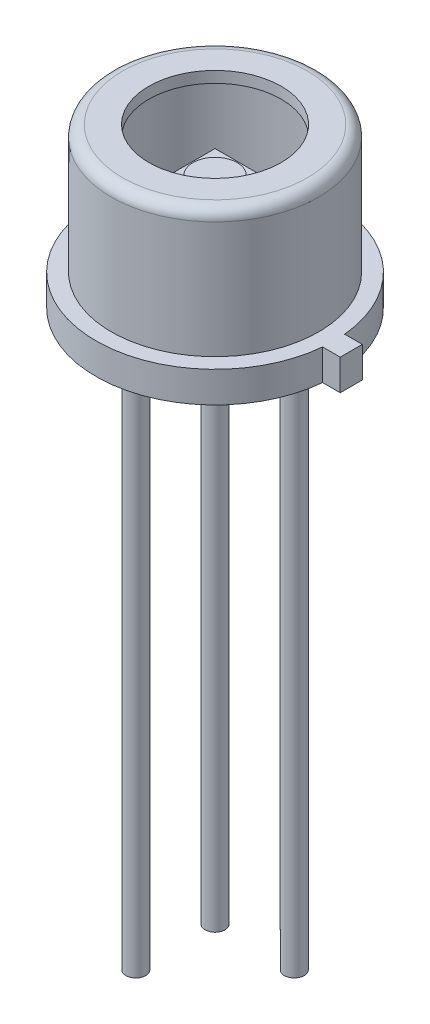
ISO-10303-21;
HEADER;
FILE_DESCRIPTION(('STEP AP214'),'2;1');
FILE_NAME('part.step','',(''),(''),'','','');
FILE_SCHEMA(('AUTOMOTIVE_DESIGN { 1 0 10303 214 1 1 1 1 }'));
ENDSEC;
DATA;
#1=APPLICATION_CONTEXT('core data for automotive mechanical design processes');
#2=APPLICATION_PROTOCOL_DEFINITION('international standard','automotive_design',2000,#1);
#3=PRODUCT_CONTEXT('',#1,'mechanical');
#4=PRODUCT('Part','Part','',(#3));
#5=PRODUCT_RELATED_PRODUCT_CATEGORY('part','',(#4));
#6=PRODUCT_DEFINITION_FORMATION('','',#4);
#7=PRODUCT_DEFINITION_CONTEXT('part definition',#1,'design');
#8=PRODUCT_DEFINITION('design','',#6,#7);
#9=PRODUCT_DEFINITION_SHAPE('','',#8);
#10=(LENGTH_UNIT() NAMED_UNIT(*) SI_UNIT(.MILLI.,.METRE.));
#11=(NAMED_UNIT(*) PLANE_ANGLE_UNIT() SI_UNIT($,.RADIAN.));
#12=(NAMED_UNIT(*) SI_UNIT($,.STERADIAN.) SOLID_ANGLE_UNIT());
#13=UNCERTAINTY_MEASURE_WITH_UNIT(LENGTH_MEASURE(1.E-05),#10,'distance_accuracy_value','');
#14=(GEOMETRIC_REPRESENTATION_CONTEXT(3) GLOBAL_UNCERTAINTY_ASSIGNED_CONTEXT((#13)) GLOBAL_UNIT_ASSIGNED_CONTEXT((#10,
#11,#12)) REPRESENTATION_CONTEXT('',''));
#15=CARTESIAN_POINT('',(0.,0.,0.));
#16=DIRECTION('',(0.,0.,1.));
#17=DIRECTION('',(1.,0.,0.));
#18=AXIS2_PLACEMENT_3D('',#15,#16,#17);
#19=CARTESIAN_POINT('',(-0.625,2.45,0.625));
#20=DIRECTION('',(1.,0.,0.));
#21=DIRECTION('',(0.,0.,-1.));
#22=AXIS2_PLACEMENT_3D('',#19,#20,#21);
#23=PLANE('',#22);
#24=DIRECTION('',(0.,0.,-1.));
#25=VECTOR('',#24,1.);
#26=CARTESIAN_POINT('',(-0.625,2.5,0.625));
#27=LINE('',#26,#25);
#28=CARTESIAN_POINT('',(-0.625,2.5,0.625));
#29=VERTEX_POINT('',#28);
#30=CARTESIAN_POINT('',(-0.624999999999999,2.5,-0.625));
#31=VERTEX_POINT('',#30);
#32=EDGE_CURVE('E115',#29,#31,#27,.T.);
#33=ORIENTED_EDGE('',*,*,#32,.T.);
#34=DIRECTION('',(0.,1.,0.));
#35=VECTOR('',#34,1.);
#36=CARTESIAN_POINT('',(-0.624999999999999,2.45,-0.625));
#37=LINE('',#36,#35);
#38=CARTESIAN_POINT('',(-0.624999999999999,2.45,-0.625));
#39=VERTEX_POINT('',#38);
#40=EDGE_CURVE('E12',#39,#31,#37,.T.);
#41=ORIENTED_EDGE('',*,*,#40,.F.);
#42=DIRECTION('',(0.,0.,-1.));
#43=VECTOR('',#42,1.);
#44=CARTESIAN_POINT('',(-0.625,2.45,0.625));
#45=LINE('',#44,#43);
#46=CARTESIAN_POINT('',(-0.625,2.45,0.625));
#47=VERTEX_POINT('',#46);
#48=EDGE_CURVE('E103',#47,#39,#45,.T.);
#49=ORIENTED_EDGE('',*,*,#48,.F.);
#50=DIRECTION('',(0.,1.,0.));
#51=VECTOR('',#50,1.);
#52=CARTESIAN_POINT('',(-0.625,2.45,0.625));
#53=LINE('',#52,#51);
#54=EDGE_CURVE('E111',#47,#29,#53,.T.);
#55=ORIENTED_EDGE('',*,*,#54,.T.);
#56=EDGE_LOOP('',(#33,#41,#49,#55));
#57=FACE_BOUND('',#56,.T.);
#58=ADVANCED_FACE('F52',(#57),#23,.F.);
#59=CARTESIAN_POINT('',(-0.624999999999999,2.45,-0.625));
#60=DIRECTION('',(0.,0.,1.));
#61=DIRECTION('',(1.,0.,0.));
#62=AXIS2_PLACEMENT_3D('',#59,#60,#61);
#63=PLANE('',#62);
#64=DIRECTION('',(1.,0.,0.));
#65=VECTOR('',#64,1.);
#66=CARTESIAN_POINT('',(-0.624999999999999,2.5,-0.625));
#67=LINE('',#66,#65);
#68=CARTESIAN_POINT('',(0.625000000000001,2.5,-0.625));
#69=VERTEX_POINT('',#68);
#70=EDGE_CURVE('E107',#31,#69,#67,.T.);
#71=ORIENTED_EDGE('',*,*,#70,.T.);
#72=DIRECTION('',(0.,1.,0.));
#73=VECTOR('',#72,1.);
#74=CARTESIAN_POINT('',(0.625000000000001,2.45,-0.625));
#75=LINE('',#74,#73);
#76=CARTESIAN_POINT('',(0.625000000000001,2.45,-0.625));
#77=VERTEX_POINT('',#76);
#78=EDGE_CURVE('E60',#77,#69,#75,.T.);
#79=ORIENTED_EDGE('',*,*,#78,.F.);
#80=DIRECTION('',(1.,0.,0.));
#81=VECTOR('',#80,1.);
#82=CARTESIAN_POINT('',(-0.624999999999999,2.45,-0.625));
#83=LINE('',#82,#81);
#84=EDGE_CURVE('E98',#39,#77,#83,.T.);
#85=ORIENTED_EDGE('',*,*,#84,.F.);
#86=ORIENTED_EDGE('',*,*,#40,.T.);
#87=EDGE_LOOP('',(#71,#79,#85,#86));
#88=FACE_BOUND('',#87,.T.);
#89=ADVANCED_FACE('F106',(#88),#63,.F.);
#90=CARTESIAN_POINT('',(0.625,2.45,0.625));
#91=DIRECTION('',(-1.,0.,0.));
#92=DIRECTION('',(0.,0.,1.));
#93=AXIS2_PLACEMENT_3D('',#90,#91,#92);
#94=PLANE('',#93);
#95=DIRECTION('',(0.,0.,1.));
#96=VECTOR('',#95,1.);
#97=CARTESIAN_POINT('',(0.625,2.5,0.625));
#98=LINE('',#97,#96);
#99=CARTESIAN_POINT('',(0.625,2.5,0.625));
#100=VERTEX_POINT('',#99);
#101=EDGE_CURVE('E85',#69,#100,#98,.T.);
#102=ORIENTED_EDGE('',*,*,#101,.T.);
#103=DIRECTION('',(0.,1.,0.));
#104=VECTOR('',#103,1.);
#105=CARTESIAN_POINT('',(0.625,2.45,0.625));
#106=LINE('',#105,#104);
#107=CARTESIAN_POINT('',(0.625,2.45,0.625));
#108=VERTEX_POINT('',#107);
#109=EDGE_CURVE('E108',#108,#100,#106,.T.);
#110=ORIENTED_EDGE('',*,*,#109,.F.);
#111=DIRECTION('',(0.,0.,1.));
#112=VECTOR('',#111,1.);
#113=CARTESIAN_POINT('',(0.625,2.45,0.625));
#114=LINE('',#113,#112);
#115=EDGE_CURVE('E101',#77,#108,#114,.T.);
#116=ORIENTED_EDGE('',*,*,#115,.F.);
#117=ORIENTED_EDGE('',*,*,#78,.T.);
#118=EDGE_LOOP('',(#102,#110,#116,#117));
#119=FACE_BOUND('',#118,.T.);
#120=ADVANCED_FACE('F109',(#119),#94,.F.);
#121=CARTESIAN_POINT('',(-0.625,2.45,0.625));
#122=DIRECTION('',(0.,0.,-1.));
#123=DIRECTION('',(-1.,0.,0.));
#124=AXIS2_PLACEMENT_3D('',#121,#122,#123);
#125=PLANE('',#124);
#126=DIRECTION('',(-1.,0.,0.));
#127=VECTOR('',#126,1.);
#128=CARTESIAN_POINT('',(-0.625,2.5,0.625));
#129=LINE('',#128,#127);
#130=EDGE_CURVE('E91',#100,#29,#129,.T.);
#131=ORIENTED_EDGE('',*,*,#130,.T.);
#132=ORIENTED_EDGE('',*,*,#54,.F.);
#133=DIRECTION('',(-1.,0.,0.));
#134=VECTOR('',#133,1.);
#135=CARTESIAN_POINT('',(-0.625,2.45,0.625));
#136=LINE('',#135,#134);
#137=EDGE_CURVE('E68',#108,#47,#136,.T.);
#138=ORIENTED_EDGE('',*,*,#137,.F.);
#139=ORIENTED_EDGE('',*,*,#109,.T.);
#140=EDGE_LOOP('',(#131,#132,#138,#139));
#141=FACE_BOUND('',#140,.T.);
#142=ADVANCED_FACE('F123',(#141),#125,.F.);
#143=CARTESIAN_POINT('',(-0.624999999999999,2.45,-0.625));
#144=DIRECTION('',(0.,-1.,0.));
#145=DIRECTION('',(0.,0.,-1.));
#146=AXIS2_PLACEMENT_3D('',#143,#144,#145);
#147=PLANE('',#146);
#148=ORIENTED_EDGE('',*,*,#48,.T.);
#149=ORIENTED_EDGE('',*,*,#84,.T.);
#150=ORIENTED_EDGE('',*,*,#115,.T.);
#151=ORIENTED_EDGE('',*,*,#137,.T.);
#152=EDGE_LOOP('',(#148,#149,#150,#151));
#153=FACE_BOUND('',#152,.T.);
#154=ADVANCED_FACE('F99',(#153),#147,.T.);
#155=CARTESIAN_POINT('',(-0.624999999999999,2.5,-0.625));
#156=DIRECTION('',(0.,-1.,0.));
#157=DIRECTION('',(0.,0.,-1.));
#158=AXIS2_PLACEMENT_3D('',#155,#156,#157);
#159=PLANE('',#158);
#160=CARTESIAN_POINT('',(0.,2.5,0.));
#161=DIRECTION('',(0.,-1.,0.));
#162=DIRECTION('',(0.,0.,-1.));
#163=AXIS2_PLACEMENT_3D('',#160,#161,#162);
#164=CIRCLE('',#163,0.5);
#165=CARTESIAN_POINT('',(0.,2.5,-0.5));
#166=VERTEX_POINT('',#165);
#167=EDGE_CURVE('E129',#166,#166,#164,.T.);
#168=ORIENTED_EDGE('',*,*,#167,.T.);
#169=EDGE_LOOP('',(#168));
#170=FACE_BOUND('',#169,.T.);
#171=ORIENTED_EDGE('',*,*,#32,.F.);
#172=ORIENTED_EDGE('',*,*,#130,.F.);
#173=ORIENTED_EDGE('',*,*,#101,.F.);
#174=ORIENTED_EDGE('',*,*,#70,.F.);
#175=EDGE_LOOP('',(#171,#172,#173,#174));
#176=FACE_BOUND('',#175,.T.);
#177=ADVANCED_FACE('F126',(#170,#176),#159,.F.);
#178=CARTESIAN_POINT('',(0.,2.6,0.));
#179=DIRECTION('',(0.,-1.,0.));
#180=DIRECTION('',(0.,0.,-1.));
#181=AXIS2_PLACEMENT_3D('',#178,#179,#180);
#182=CYLINDRICAL_SURFACE('',#181,0.5);
#183=CARTESIAN_POINT('',(0.,2.6,0.));
#184=DIRECTION('',(0.,-1.,0.));
#185=DIRECTION('',(0.,0.,-1.));
#186=AXIS2_PLACEMENT_3D('',#183,#184,#185);
#187=CIRCLE('',#186,0.5);
#188=CARTESIAN_POINT('',(0.,2.6,-0.5));
#189=VERTEX_POINT('',#188);
#190=EDGE_CURVE('E118',#189,#189,#187,.T.);
#191=ORIENTED_EDGE('',*,*,#190,.T.);
#192=EDGE_LOOP('',(#191));
#193=FACE_BOUND('',#192,.T.);
#194=ORIENTED_EDGE('',*,*,#167,.F.);
#195=EDGE_LOOP('',(#194));
#196=FACE_BOUND('',#195,.T.);
#197=ADVANCED_FACE('F135',(#193,#196),#182,.T.);
#198=CARTESIAN_POINT('',(0.,2.6,0.));
#199=DIRECTION('',(0.,-1.,0.));
#200=DIRECTION('',(0.,0.,-1.));
#201=AXIS2_PLACEMENT_3D('',#198,#199,#200);
#202=PLANE('',#201);
#203=ORIENTED_EDGE('',*,*,#190,.F.);
#204=EDGE_LOOP('',(#203));
#205=FACE_BOUND('',#204,.T.);
#206=ADVANCED_FACE('F138',(#205),#202,.F.);
#207=CLOSED_SHELL('',(#58,#89,#120,#142,#154,#177,#197,#206));
#208=MANIFOLD_SOLID_BREP('B2',#207);
#209=CARTESIAN_POINT('',(2.7,0.,0.));
#210=DIRECTION('',(0.,1.,0.));
#211=DIRECTION('',(0.,0.,1.));
#212=AXIS2_PLACEMENT_3D('',#209,#210,#211);
#213=PLANE('',#212);
#214=CARTESIAN_POINT('',(0.898025612106904,0.,-0.898025612106927));
#215=DIRECTION('',(0.,1.,0.));
#216=DIRECTION('',(0.,0.,1.));
#217=AXIS2_PLACEMENT_3D('',#214,#215,#216);
#218=CIRCLE('',#217,0.225);
#219=CARTESIAN_POINT('',(0.898025612106904,0.,-0.673025612106927));
#220=VERTEX_POINT('',#219);
#221=EDGE_CURVE('E221',#220,#220,#218,.F.);
#222=ORIENTED_EDGE('',*,*,#221,.F.);
#223=EDGE_LOOP('',(#222));
#224=FACE_BOUND('',#223,.T.);
#225=CARTESIAN_POINT('',(0.,0.,0.));
#226=DIRECTION('',(0.,-1.,0.));
#227=DIRECTION('',(0.,0.,-1.));
#228=AXIS2_PLACEMENT_3D('',#225,#226,#227);
#229=CIRCLE('',#228,2.7);
#230=CARTESIAN_POINT('',(2.68840101175401,0.,0.250000000000029));
#231=VERTEX_POINT('',#230);
#232=CARTESIAN_POINT('',(2.68840101175402,0.,-0.249999999999971));
#233=VERTEX_POINT('',#232);
#234=EDGE_CURVE('E228',#231,#233,#229,.T.);
#235=ORIENTED_EDGE('',*,*,#234,.T.);
#236=DIRECTION('',(-1.,0.,0.));
#237=VECTOR('',#236,1.);
#238=CARTESIAN_POINT('',(0.,0.,-0.250000000000001));
#239=LINE('',#238,#237);
#240=CARTESIAN_POINT('',(3.08840101175402,0.,-0.249999999999967));
#241=VERTEX_POINT('',#240);
#242=EDGE_CURVE('E278',#241,#233,#239,.T.);
#243=ORIENTED_EDGE('',*,*,#242,.F.);
#244=DIRECTION('',(0.,0.,1.));
#245=VECTOR('',#244,1.);
#246=CARTESIAN_POINT('',(3.08840101175401,0.,0.));
#247=LINE('',#246,#245);
#248=CARTESIAN_POINT('',(3.08840101175401,0.,0.250000000000033));
#249=VERTEX_POINT('',#248);
#250=EDGE_CURVE('E272',#241,#249,#247,.T.);
#251=ORIENTED_EDGE('',*,*,#250,.T.);
#252=DIRECTION('',(-1.,0.,0.));
#253=VECTOR('',#252,1.);
#254=CARTESIAN_POINT('',(0.,0.,0.250000000000001));
#255=LINE('',#254,#253);
#256=EDGE_CURVE('E270',#249,#231,#255,.T.);
#257=ORIENTED_EDGE('',*,*,#256,.T.);
#258=EDGE_LOOP('',(#235,#243,#251,#257));
#259=FACE_BOUND('',#258,.T.);
#260=CARTESIAN_POINT('',(-0.898025612106926,0.,0.898025612106904));
#261=DIRECTION('',(0.,1.,0.));
#262=DIRECTION('',(0.,0.,1.));
#263=AXIS2_PLACEMENT_3D('',#260,#261,#262);
#264=CIRCLE('',#263,0.225);
#265=CARTESIAN_POINT('',(-0.898025612106926,0.,1.1230256121069));
#266=VERTEX_POINT('',#265);
#267=EDGE_CURVE('E306',#266,#266,#264,.F.);
#268=ORIENTED_EDGE('',*,*,#267,.F.);
#269=EDGE_LOOP('',(#268));
#270=FACE_BOUND('',#269,.T.);
#271=CARTESIAN_POINT('',(-0.898025612106927,0.,-0.898025612106927));
#272=DIRECTION('',(0.,1.,0.));
#273=DIRECTION('',(0.,0.,1.));
#274=AXIS2_PLACEMENT_3D('',#271,#272,#273);
#275=CIRCLE('',#274,0.225);
#276=CARTESIAN_POINT('',(-0.898025612106927,0.,-0.673025612106927));
#277=VERTEX_POINT('',#276);
#278=EDGE_CURVE('E50',#277,#277,#275,.F.);
#279=ORIENTED_EDGE('',*,*,#278,.F.);
#280=EDGE_LOOP('',(#279));
#281=FACE_BOUND('',#280,.T.);
#282=ADVANCED_FACE('F213',(#224,#259,#270,#281),#213,.F.);
#283=CARTESIAN_POINT('',(2.096,3.6,0.));
#284=DIRECTION('',(0.,1.,0.));
#285=DIRECTION('',(0.,0.,1.));
#286=AXIS2_PLACEMENT_3D('',#283,#284,#285);
#287=PLANE('',#286);
#288=CARTESIAN_POINT('',(0.,3.6,0.));
#289=DIRECTION('',(0.,-1.,0.));
#290=DIRECTION('',(0.,0.,-1.));
#291=AXIS2_PLACEMENT_3D('',#288,#289,#290);
#292=CIRCLE('',#291,1.5);
#293=CARTESIAN_POINT('',(0.,3.6,-1.5));
#294=VERTEX_POINT('',#293);
#295=EDGE_CURVE('E303',#294,#294,#292,.T.);
#296=ORIENTED_EDGE('',*,*,#295,.T.);
#297=EDGE_LOOP('',(#296));
#298=FACE_BOUND('',#297,.T.);
#299=CARTESIAN_POINT('',(0.,3.6,0.));
#300=DIRECTION('',(0.,-1.,0.));
#301=DIRECTION('',(0.,0.,-1.));
#302=AXIS2_PLACEMENT_3D('',#299,#300,#301);
#303=CIRCLE('',#302,2.096);
#304=CARTESIAN_POINT('',(0.,3.6,-2.096));
#305=VERTEX_POINT('',#304);
#306=EDGE_CURVE('E288',#305,#305,#303,.T.);
#307=ORIENTED_EDGE('',*,*,#306,.F.);
#308=EDGE_LOOP('',(#307));
#309=FACE_BOUND('',#308,.T.);
#310=ADVANCED_FACE('F215',(#298,#309),#287,.T.);
#311=CARTESIAN_POINT('',(0.,0.,0.));
#312=DIRECTION('',(0.,-1.,0.));
#313=DIRECTION('',(0.,0.,-1.));
#314=AXIS2_PLACEMENT_3D('',#311,#312,#313);
#315=CYLINDRICAL_SURFACE('',#314,1.5);
#316=ORIENTED_EDGE('',*,*,#295,.F.);
#317=EDGE_LOOP('',(#316));
#318=FACE_BOUND('',#317,.T.);
#319=CARTESIAN_POINT('',(0.,3.346,0.));
#320=DIRECTION('',(0.,-1.,0.));
#321=DIRECTION('',(0.,0.,-1.));
#322=AXIS2_PLACEMENT_3D('',#319,#320,#321);
#323=CIRCLE('',#322,1.5);
#324=CARTESIAN_POINT('',(0.,3.346,-1.5));
#325=VERTEX_POINT('',#324);
#326=EDGE_CURVE('E300',#325,#325,#323,.T.);
#327=ORIENTED_EDGE('',*,*,#326,.T.);
#328=EDGE_LOOP('',(#327));
#329=FACE_BOUND('',#328,.T.);
#330=ADVANCED_FACE('F383',(#318,#329),#315,.F.);
#331=CARTESIAN_POINT('',(2.096,3.346,0.));
#332=DIRECTION('',(0.,1.,0.));
#333=DIRECTION('',(0.,0.,1.));
#334=AXIS2_PLACEMENT_3D('',#331,#332,#333);
#335=PLANE('',#334);
#336=ORIENTED_EDGE('',*,*,#326,.F.);
#337=EDGE_LOOP('',(#336));
#338=FACE_BOUND('',#337,.T.);
#339=CARTESIAN_POINT('',(0.,3.346,0.));
#340=DIRECTION('',(0.,-1.,0.));
#341=DIRECTION('',(0.,0.,-1.));
#342=AXIS2_PLACEMENT_3D('',#339,#340,#341);
#343=CIRCLE('',#342,2.096);
#344=CARTESIAN_POINT('',(0.,3.346,-2.096));
#345=VERTEX_POINT('',#344);
#346=EDGE_CURVE('E297',#345,#345,#343,.T.);
#347=ORIENTED_EDGE('',*,*,#346,.T.);
#348=EDGE_LOOP('',(#347));
#349=FACE_BOUND('',#348,.T.);
#350=ADVANCED_FACE('F380',(#338,#349),#335,.F.);
#351=CARTESIAN_POINT('',(0.,0.,0.));
#352=DIRECTION('',(0.,-1.,0.));
#353=DIRECTION('',(0.,0.,-1.));
#354=AXIS2_PLACEMENT_3D('',#351,#352,#353);
#355=CYLINDRICAL_SURFACE('',#354,2.096);
#356=ORIENTED_EDGE('',*,*,#346,.F.);
#357=EDGE_LOOP('',(#356));
#358=FACE_BOUND('',#357,.T.);
#359=CARTESIAN_POINT('',(0.,0.446,0.));
#360=DIRECTION('',(0.,1.,0.));
#361=DIRECTION('',(0.,0.,1.));
#362=AXIS2_PLACEMENT_3D('',#359,#360,#361);
#363=CIRCLE('',#362,2.096);
#364=CARTESIAN_POINT('',(0.,0.446,2.096));
#365=VERTEX_POINT('',#364);
#366=EDGE_CURVE('E285',#365,#365,#363,.F.);
#367=ORIENTED_EDGE('',*,*,#366,.T.);
#368=EDGE_LOOP('',(#367));
#369=FACE_BOUND('',#368,.T.);
#370=ADVANCED_FACE('F376',(#358,#369),#355,.F.);
#371=CARTESIAN_POINT('',(0.,0.,0.));
#372=DIRECTION('',(0.,-1.,0.));
#373=DIRECTION('',(0.,0.,-1.));
#374=AXIS2_PLACEMENT_3D('',#371,#372,#373);
#375=CYLINDRICAL_SURFACE('',#374,2.7);
#376=DIRECTION('',(0.,-1.,0.));
#377=VECTOR('',#376,1.);
#378=CARTESIAN_POINT('',(2.68840101175401,1.34031242374329,0.250000000000029));
#379=LINE('',#378,#377);
#380=CARTESIAN_POINT('',(2.68840101175401,0.7,0.250000000000029));
#381=VERTEX_POINT('',#380);
#382=EDGE_CURVE('E261',#381,#231,#379,.T.);
#383=ORIENTED_EDGE('',*,*,#382,.F.);
#384=CARTESIAN_POINT('',(0.,0.7,0.));
#385=DIRECTION('',(0.,-1.,0.));
#386=DIRECTION('',(0.,0.,-1.));
#387=AXIS2_PLACEMENT_3D('',#384,#385,#386);
#388=CIRCLE('',#387,2.7);
#389=CARTESIAN_POINT('',(2.68840101175402,0.7,-0.249999999999971));
#390=VERTEX_POINT('',#389);
#391=EDGE_CURVE('E252',#381,#390,#388,.T.);
#392=ORIENTED_EDGE('',*,*,#391,.T.);
#393=DIRECTION('',(0.,-1.,0.));
#394=VECTOR('',#393,1.);
#395=CARTESIAN_POINT('',(2.68840101175402,1.34031242374329,-0.249999999999971));
#396=LINE('',#395,#394);
#397=EDGE_CURVE('E233',#390,#233,#396,.T.);
#398=ORIENTED_EDGE('',*,*,#397,.T.);
#399=ORIENTED_EDGE('',*,*,#234,.F.);
#400=EDGE_LOOP('',(#383,#392,#398,#399));
#401=FACE_BOUND('',#400,.T.);
#402=ADVANCED_FACE('F262',(#401),#375,.T.);
#403=CARTESIAN_POINT('',(2.7,0.7,0.));
#404=DIRECTION('',(0.,1.,0.));
#405=DIRECTION('',(0.,0.,1.));
#406=AXIS2_PLACEMENT_3D('',#403,#404,#405);
#407=PLANE('',#406);
#408=CARTESIAN_POINT('',(0.,0.7,0.));
#409=DIRECTION('',(0.,-1.,0.));
#410=DIRECTION('',(0.,0.,-1.));
#411=AXIS2_PLACEMENT_3D('',#408,#409,#410);
#412=CIRCLE('',#411,2.35);
#413=CARTESIAN_POINT('',(0.,0.7,-2.35));
#414=VERTEX_POINT('',#413);
#415=EDGE_CURVE('E259',#414,#414,#412,.T.);
#416=ORIENTED_EDGE('',*,*,#415,.T.);
#417=EDGE_LOOP('',(#416));
#418=FACE_BOUND('',#417,.T.);
#419=ORIENTED_EDGE('',*,*,#391,.F.);
#420=DIRECTION('',(-1.,0.,0.));
#421=VECTOR('',#420,1.);
#422=CARTESIAN_POINT('',(0.,0.7,0.250000000000001));
#423=LINE('',#422,#421);
#424=CARTESIAN_POINT('',(3.08840101175401,0.7,0.250000000000033));
#425=VERTEX_POINT('',#424);
#426=EDGE_CURVE('E255',#425,#381,#423,.T.);
#427=ORIENTED_EDGE('',*,*,#426,.F.);
#428=DIRECTION('',(0.,0.,1.));
#429=VECTOR('',#428,1.);
#430=CARTESIAN_POINT('',(3.08840101175401,0.7,0.));
#431=LINE('',#430,#429);
#432=CARTESIAN_POINT('',(3.08840101175402,0.7,-0.249999999999967));
#433=VERTEX_POINT('',#432);
#434=EDGE_CURVE('E276',#433,#425,#431,.T.);
#435=ORIENTED_EDGE('',*,*,#434,.F.);
#436=DIRECTION('',(-1.,0.,0.));
#437=VECTOR('',#436,1.);
#438=CARTESIAN_POINT('',(0.,0.7,-0.250000000000001));
#439=LINE('',#438,#437);
#440=EDGE_CURVE('E258',#433,#390,#439,.T.);
#441=ORIENTED_EDGE('',*,*,#440,.T.);
#442=EDGE_LOOP('',(#419,#427,#435,#441));
#443=FACE_BOUND('',#442,.T.);
#444=ADVANCED_FACE('F253',(#418,#443),#407,.T.);
#445=CARTESIAN_POINT('',(0.,0.,0.));
#446=DIRECTION('',(0.,-1.,0.));
#447=DIRECTION('',(0.,0.,-1.));
#448=AXIS2_PLACEMENT_3D('',#445,#446,#447);
#449=CYLINDRICAL_SURFACE('',#448,2.35);
#450=CARTESIAN_POINT('',(0.,3.346,0.));
#451=DIRECTION('',(0.,-1.,0.));
#452=DIRECTION('',(0.,0.,-1.));
#453=AXIS2_PLACEMENT_3D('',#450,#451,#452);
#454=CIRCLE('',#453,2.35);
#455=CARTESIAN_POINT('',(0.,3.346,-2.35));
#456=VERTEX_POINT('',#455);
#457=EDGE_CURVE('E291',#456,#456,#454,.T.);
#458=ORIENTED_EDGE('',*,*,#457,.T.);
#459=EDGE_LOOP('',(#458));
#460=FACE_BOUND('',#459,.T.);
#461=ORIENTED_EDGE('',*,*,#415,.F.);
#462=EDGE_LOOP('',(#461));
#463=FACE_BOUND('',#462,.T.);
#464=ADVANCED_FACE('F367',(#460,#463),#449,.T.);
#465=CARTESIAN_POINT('',(0.,3.346,0.));
#466=DIRECTION('',(0.,-1.,0.));
#467=DIRECTION('',(0.,0.,-1.));
#468=AXIS2_PLACEMENT_3D('',#465,#466,#467);
#469=TOROIDAL_SURFACE('',#468,2.096,0.254);
#470=ORIENTED_EDGE('',*,*,#306,.T.);
#471=EDGE_LOOP('',(#470));
#472=FACE_BOUND('',#471,.T.);
#473=ORIENTED_EDGE('',*,*,#457,.F.);
#474=EDGE_LOOP('',(#473));
#475=FACE_BOUND('',#474,.T.);
#476=ADVANCED_FACE('F363',(#472,#475),#469,.T.);
#477=CARTESIAN_POINT('',(2.7,0.446,0.));
#478=DIRECTION('',(0.,1.,0.));
#479=DIRECTION('',(0.,0.,1.));
#480=AXIS2_PLACEMENT_3D('',#477,#478,#479);
#481=PLANE('',#480);
#482=ORIENTED_EDGE('',*,*,#366,.F.);
#483=EDGE_LOOP('',(#482));
#484=FACE_BOUND('',#483,.T.);
#485=ADVANCED_FACE('F360',(#484),#481,.T.);
#486=CARTESIAN_POINT('',(0.,1.34031242374329,0.250000000000001));
#487=DIRECTION('',(0.,0.,1.));
#488=DIRECTION('',(1.,0.,0.));
#489=AXIS2_PLACEMENT_3D('',#486,#487,#488);
#490=PLANE('',#489);
#491=DIRECTION('',(0.,-1.,0.));
#492=VECTOR('',#491,1.);
#493=CARTESIAN_POINT('',(3.08840101175401,1.34031242374329,0.250000000000033));
#494=LINE('',#493,#492);
#495=EDGE_CURVE('E269',#425,#249,#494,.T.);
#496=ORIENTED_EDGE('',*,*,#495,.F.);
#497=ORIENTED_EDGE('',*,*,#426,.T.);
#498=ORIENTED_EDGE('',*,*,#382,.T.);
#499=ORIENTED_EDGE('',*,*,#256,.F.);
#500=EDGE_LOOP('',(#496,#497,#498,#499));
#501=FACE_BOUND('',#500,.T.);
#502=ADVANCED_FACE('F268',(#501),#490,.T.);
#503=CARTESIAN_POINT('',(0.,1.34031242374329,-0.250000000000001));
#504=DIRECTION('',(0.,0.,1.));
#505=DIRECTION('',(1.,0.,0.));
#506=AXIS2_PLACEMENT_3D('',#503,#504,#505);
#507=PLANE('',#506);
#508=ORIENTED_EDGE('',*,*,#440,.F.);
#509=DIRECTION('',(0.,-1.,0.));
#510=VECTOR('',#509,1.);
#511=CARTESIAN_POINT('',(3.08840101175402,1.34031242374329,-0.249999999999967));
#512=LINE('',#511,#510);
#513=EDGE_CURVE('E281',#433,#241,#512,.T.);
#514=ORIENTED_EDGE('',*,*,#513,.T.);
#515=ORIENTED_EDGE('',*,*,#242,.T.);
#516=ORIENTED_EDGE('',*,*,#397,.F.);
#517=EDGE_LOOP('',(#508,#514,#515,#516));
#518=FACE_BOUND('',#517,.T.);
#519=ADVANCED_FACE('F353',(#518),#507,.F.);
#520=CARTESIAN_POINT('',(3.08840101175401,1.34031242374329,0.));
#521=DIRECTION('',(1.,0.,0.));
#522=DIRECTION('',(0.,0.,-1.));
#523=AXIS2_PLACEMENT_3D('',#520,#521,#522);
#524=PLANE('',#523);
#525=ORIENTED_EDGE('',*,*,#513,.F.);
#526=ORIENTED_EDGE('',*,*,#434,.T.);
#527=ORIENTED_EDGE('',*,*,#495,.T.);
#528=ORIENTED_EDGE('',*,*,#250,.F.);
#529=EDGE_LOOP('',(#525,#526,#527,#528));
#530=FACE_BOUND('',#529,.T.);
#531=ADVANCED_FACE('F349',(#530),#524,.T.);
#532=CARTESIAN_POINT('',(-0.898025612106926,-13.,0.898025612106904));
#533=DIRECTION('',(0.,1.,0.));
#534=DIRECTION('',(0.,0.,1.));
#535=AXIS2_PLACEMENT_3D('',#532,#533,#534);
#536=CYLINDRICAL_SURFACE('',#535,0.225);
#537=CARTESIAN_POINT('',(-0.898025612106926,-13.,0.898025612106904));
#538=DIRECTION('',(0.,-1.,0.));
#539=DIRECTION('',(0.,0.,-1.));
#540=AXIS2_PLACEMENT_3D('',#537,#538,#539);
#541=CIRCLE('',#540,0.225);
#542=CARTESIAN_POINT('',(-0.898025612106926,-13.,0.673025612106904));
#543=VERTEX_POINT('',#542);
#544=EDGE_CURVE('E280',#543,#543,#541,.T.);
#545=ORIENTED_EDGE('',*,*,#544,.F.);
#546=EDGE_LOOP('',(#545));
#547=FACE_BOUND('',#546,.T.);
#548=ORIENTED_EDGE('',*,*,#267,.T.);
#549=EDGE_LOOP('',(#548));
#550=FACE_BOUND('',#549,.T.);
#551=ADVANCED_FACE('F345',(#547,#550),#536,.T.);
#552=CARTESIAN_POINT('',(-0.898025612106926,-13.,0.898025612106904));
#553=DIRECTION('',(0.,-1.,0.));
#554=DIRECTION('',(0.,0.,-1.));
#555=AXIS2_PLACEMENT_3D('',#552,#553,#554);
#556=PLANE('',#555);
#557=ORIENTED_EDGE('',*,*,#544,.T.);
#558=EDGE_LOOP('',(#557));
#559=FACE_BOUND('',#558,.T.);
#560=ADVANCED_FACE('F341',(#559),#556,.T.);
#561=CARTESIAN_POINT('',(0.898025612106904,-13.,-0.898025612106927));
#562=DIRECTION('',(0.,1.,0.));
#563=DIRECTION('',(0.,0.,1.));
#564=AXIS2_PLACEMENT_3D('',#561,#562,#563);
#565=CYLINDRICAL_SURFACE('',#564,0.225);
#566=CARTESIAN_POINT('',(0.898025612106904,-13.,-0.898025612106927));
#567=DIRECTION('',(0.,-1.,0.));
#568=DIRECTION('',(0.,0.,-1.));
#569=AXIS2_PLACEMENT_3D('',#566,#567,#568);
#570=CIRCLE('',#569,0.225);
#571=CARTESIAN_POINT('',(0.898025612106904,-13.,-1.12302561210693));
#572=VERTEX_POINT('',#571);
#573=EDGE_CURVE('E535',#572,#572,#570,.T.);
#574=ORIENTED_EDGE('',*,*,#573,.F.);
#575=EDGE_LOOP('',(#574));
#576=FACE_BOUND('',#575,.T.);
#577=ORIENTED_EDGE('',*,*,#221,.T.);
#578=EDGE_LOOP('',(#577));
#579=FACE_BOUND('',#578,.T.);
#580=ADVANCED_FACE('F311',(#576,#579),#565,.T.);
#581=CARTESIAN_POINT('',(0.898025612106904,-13.,-0.898025612106927));
#582=DIRECTION('',(0.,-1.,0.));
#583=DIRECTION('',(0.,0.,-1.));
#584=AXIS2_PLACEMENT_3D('',#581,#582,#583);
#585=PLANE('',#584);
#586=ORIENTED_EDGE('',*,*,#573,.T.);
#587=EDGE_LOOP('',(#586));
#588=FACE_BOUND('',#587,.T.);
#589=ADVANCED_FACE('F326',(#588),#585,.T.);
#590=CARTESIAN_POINT('',(-0.898025612106927,-13.,-0.898025612106927));
#591=DIRECTION('',(0.,1.,0.));
#592=DIRECTION('',(0.,0.,1.));
#593=AXIS2_PLACEMENT_3D('',#590,#591,#592);
#594=CYLINDRICAL_SURFACE('',#593,0.225);
#595=CARTESIAN_POINT('',(-0.898025612106927,-13.,-0.898025612106927));
#596=DIRECTION('',(0.,-1.,0.));
#597=DIRECTION('',(0.,0.,-1.));
#598=AXIS2_PLACEMENT_3D('',#595,#596,#597);
#599=CIRCLE('',#598,0.225);
#600=CARTESIAN_POINT('',(-0.898025612106927,-13.,-1.12302561210693));
#601=VERTEX_POINT('',#600);
#602=EDGE_CURVE('E538',#601,#601,#599,.T.);
#603=ORIENTED_EDGE('',*,*,#602,.F.);
#604=EDGE_LOOP('',(#603));
#605=FACE_BOUND('',#604,.T.);
#606=ORIENTED_EDGE('',*,*,#278,.T.);
#607=EDGE_LOOP('',(#606));
#608=FACE_BOUND('',#607,.T.);
#609=ADVANCED_FACE('F323',(#605,#608),#594,.T.);
#610=CARTESIAN_POINT('',(-0.898025612106927,-13.,-0.898025612106927));
#611=DIRECTION('',(0.,-1.,0.));
#612=DIRECTION('',(0.,0.,-1.));
#613=AXIS2_PLACEMENT_3D('',#610,#611,#612);
#614=PLANE('',#613);
#615=ORIENTED_EDGE('',*,*,#602,.T.);
#616=EDGE_LOOP('',(#615));
#617=FACE_BOUND('',#616,.T.);
#618=ADVANCED_FACE('F325',(#617),#614,.T.);
#619=CLOSED_SHELL('',(#282,#310,#330,#350,#370,#402,#444,#464,#476,#485,#502,#519,#531,#551,
#560,#580,#589,#609,#618));
#620=MANIFOLD_SOLID_BREP('B6',#619);
#621=ADVANCED_BREP_SHAPE_REPRESENTATION('',(#18,#208,#620),#14);
#622=SHAPE_DEFINITION_REPRESENTATION(#9,#621);
ENDSEC;
END-ISO-10303-21;
